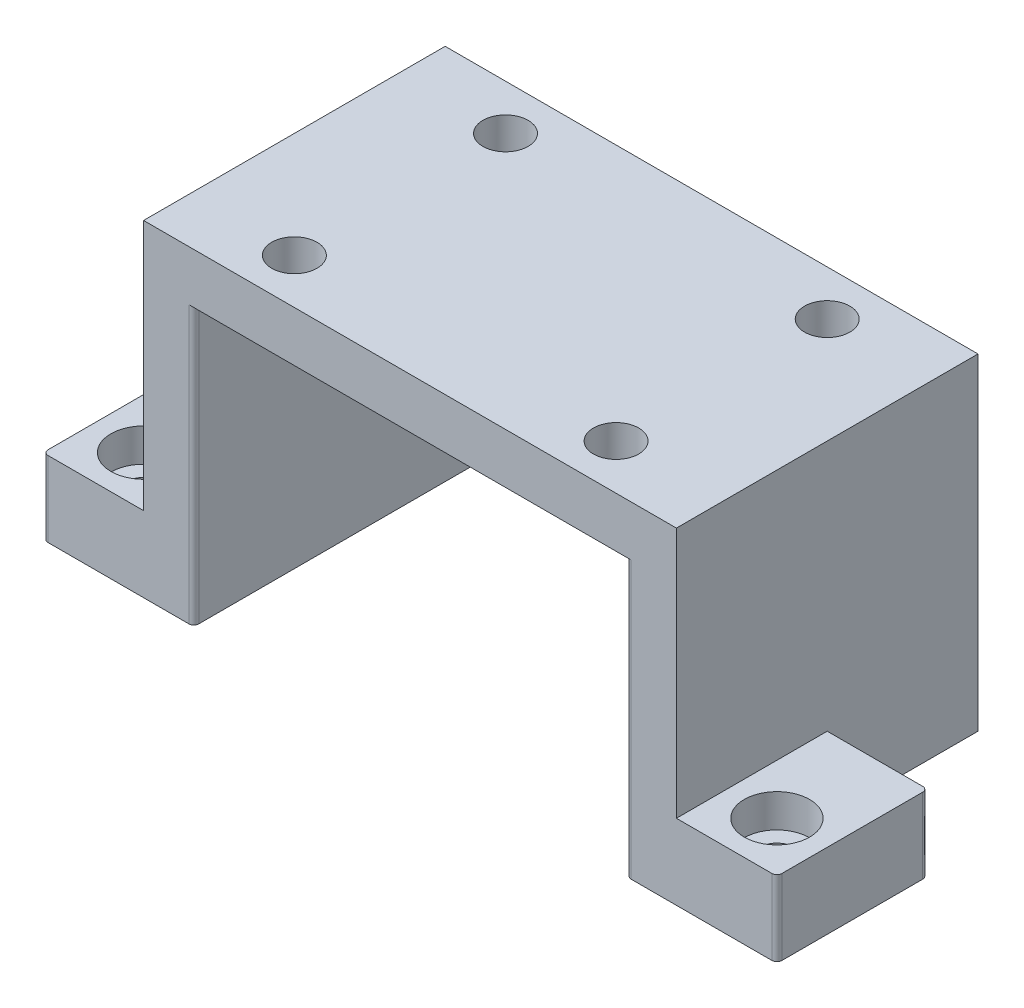
ISO-10303-21;
HEADER;
FILE_DESCRIPTION(('STEP AP214'),'2;1');
FILE_NAME('part.step','',(''),(''),'','','');
FILE_SCHEMA(('AUTOMOTIVE_DESIGN { 1 0 10303 214 1 1 1 1 }'));
ENDSEC;
DATA;
#1=APPLICATION_CONTEXT('core data for automotive mechanical design processes');
#2=APPLICATION_PROTOCOL_DEFINITION('international standard','automotive_design',2000,#1);
#3=PRODUCT_CONTEXT('',#1,'mechanical');
#4=PRODUCT('Part','Part','',(#3));
#5=PRODUCT_RELATED_PRODUCT_CATEGORY('part','',(#4));
#6=PRODUCT_DEFINITION_FORMATION('','',#4);
#7=PRODUCT_DEFINITION_CONTEXT('part definition',#1,'design');
#8=PRODUCT_DEFINITION('design','',#6,#7);
#9=PRODUCT_DEFINITION_SHAPE('','',#8);
#10=(LENGTH_UNIT() NAMED_UNIT(*) SI_UNIT(.MILLI.,.METRE.));
#11=(NAMED_UNIT(*) PLANE_ANGLE_UNIT() SI_UNIT($,.RADIAN.));
#12=(NAMED_UNIT(*) SI_UNIT($,.STERADIAN.) SOLID_ANGLE_UNIT());
#13=UNCERTAINTY_MEASURE_WITH_UNIT(LENGTH_MEASURE(1.E-05),#10,'distance_accuracy_value','');
#14=(GEOMETRIC_REPRESENTATION_CONTEXT(3) GLOBAL_UNCERTAINTY_ASSIGNED_CONTEXT((#13)) GLOBAL_UNIT_ASSIGNED_CONTEXT((#10,
#11,#12)) REPRESENTATION_CONTEXT('',''));
#15=CARTESIAN_POINT('',(0.,0.,0.));
#16=DIRECTION('',(0.,0.,1.));
#17=DIRECTION('',(1.,0.,0.));
#18=AXIS2_PLACEMENT_3D('',#15,#16,#17);
#19=CARTESIAN_POINT('',(-53.,10.,30.));
#20=DIRECTION('',(1.,0.,0.));
#21=DIRECTION('',(0.,0.,-1.));
#22=AXIS2_PLACEMENT_3D('',#19,#20,#21);
#23=PLANE('',#22);
#24=DIRECTION('',(0.,0.,-1.));
#25=VECTOR('',#24,1.);
#26=CARTESIAN_POINT('',(-53.,-40.,-30.));
#27=LINE('',#26,#25);
#28=CARTESIAN_POINT('',(-53.,-40.,30.));
#29=VERTEX_POINT('',#28);
#30=CARTESIAN_POINT('',(-53.,-40.,-30.));
#31=VERTEX_POINT('',#30);
#32=EDGE_CURVE('E204',#29,#31,#27,.T.);
#33=ORIENTED_EDGE('',*,*,#32,.F.);
#34=DIRECTION('',(0.,-1.,0.));
#35=VECTOR('',#34,1.);
#36=CARTESIAN_POINT('',(-53.,10.,30.));
#37=LINE('',#36,#35);
#38=CARTESIAN_POINT('',(-53.,10.,30.));
#39=VERTEX_POINT('',#38);
#40=EDGE_CURVE('E209',#39,#29,#37,.T.);
#41=ORIENTED_EDGE('',*,*,#40,.F.);
#42=DIRECTION('',(0.,0.,1.));
#43=VECTOR('',#42,1.);
#44=CARTESIAN_POINT('',(-53.,10.,30.));
#45=LINE('',#44,#43);
#46=CARTESIAN_POINT('',(-53.,10.,-30.));
#47=VERTEX_POINT('',#46);
#48=EDGE_CURVE('E206',#47,#39,#45,.T.);
#49=ORIENTED_EDGE('',*,*,#48,.F.);
#50=DIRECTION('',(0.,-1.,0.));
#51=VECTOR('',#50,1.);
#52=CARTESIAN_POINT('',(-53.,10.,-30.));
#53=LINE('',#52,#51);
#54=EDGE_CURVE('E191',#47,#31,#53,.T.);
#55=ORIENTED_EDGE('',*,*,#54,.T.);
#56=EDGE_LOOP('',(#33,#41,#49,#55));
#57=FACE_BOUND('',#56,.T.);
#58=ADVANCED_FACE('F42',(#57),#23,.F.);
#59=CARTESIAN_POINT('',(53.,10.,30.));
#60=DIRECTION('',(-1.,0.,0.));
#61=DIRECTION('',(0.,0.,1.));
#62=AXIS2_PLACEMENT_3D('',#59,#60,#61);
#63=PLANE('',#62);
#64=DIRECTION('',(0.,0.,1.));
#65=VECTOR('',#64,1.);
#66=CARTESIAN_POINT('',(53.,-40.,30.));
#67=LINE('',#66,#65);
#68=CARTESIAN_POINT('',(53.,-40.,0.));
#69=VERTEX_POINT('',#68);
#70=CARTESIAN_POINT('',(53.,-40.,30.));
#71=VERTEX_POINT('',#70);
#72=EDGE_CURVE('E235',#69,#71,#67,.T.);
#73=ORIENTED_EDGE('',*,*,#72,.F.);
#74=DIRECTION('',(0.,1.,0.));
#75=VECTOR('',#74,1.);
#76=CARTESIAN_POINT('',(53.,-40.,0.));
#77=LINE('',#76,#75);
#78=CARTESIAN_POINT('',(53.,-55.,0.));
#79=VERTEX_POINT('',#78);
#80=EDGE_CURVE('E229',#79,#69,#77,.T.);
#81=ORIENTED_EDGE('',*,*,#80,.F.);
#82=DIRECTION('',(0.,0.,1.));
#83=VECTOR('',#82,1.);
#84=CARTESIAN_POINT('',(53.,-55.,30.));
#85=LINE('',#84,#83);
#86=CARTESIAN_POINT('',(53.,-55.,-30.));
#87=VERTEX_POINT('',#86);
#88=EDGE_CURVE('E255',#87,#79,#85,.T.);
#89=ORIENTED_EDGE('',*,*,#88,.F.);
#90=DIRECTION('',(0.,-1.,0.));
#91=VECTOR('',#90,1.);
#92=CARTESIAN_POINT('',(53.,10.,-30.));
#93=LINE('',#92,#91);
#94=CARTESIAN_POINT('',(53.,10.,-30.));
#95=VERTEX_POINT('',#94);
#96=EDGE_CURVE('E208',#95,#87,#93,.T.);
#97=ORIENTED_EDGE('',*,*,#96,.F.);
#98=DIRECTION('',(0.,0.,-1.));
#99=VECTOR('',#98,1.);
#100=CARTESIAN_POINT('',(53.,10.,30.));
#101=LINE('',#100,#99);
#102=CARTESIAN_POINT('',(53.,10.,30.));
#103=VERTEX_POINT('',#102);
#104=EDGE_CURVE('E290',#103,#95,#101,.T.);
#105=ORIENTED_EDGE('',*,*,#104,.F.);
#106=DIRECTION('',(0.,-1.,0.));
#107=VECTOR('',#106,1.);
#108=CARTESIAN_POINT('',(53.,10.,30.));
#109=LINE('',#108,#107);
#110=EDGE_CURVE('E303',#103,#71,#109,.T.);
#111=ORIENTED_EDGE('',*,*,#110,.T.);
#112=EDGE_LOOP('',(#73,#81,#89,#97,#105,#111));
#113=FACE_BOUND('',#112,.T.);
#114=ADVANCED_FACE('F518',(#113),#63,.F.);
#115=CARTESIAN_POINT('',(0.,0.,0.));
#116=DIRECTION('',(0.,-1.,0.));
#117=DIRECTION('',(0.,0.,-1.));
#118=AXIS2_PLACEMENT_3D('',#115,#116,#117);
#119=PLANE('',#118);
#120=CARTESIAN_POINT('',(-32.,0.,21.));
#121=DIRECTION('',(0.,-1.,0.));
#122=DIRECTION('',(0.,0.,-1.));
#123=AXIS2_PLACEMENT_3D('',#120,#121,#122);
#124=CIRCLE('',#123,4.5);
#125=CARTESIAN_POINT('',(-32.,0.,16.5));
#126=VERTEX_POINT('',#125);
#127=EDGE_CURVE('E215',#126,#126,#124,.T.);
#128=ORIENTED_EDGE('',*,*,#127,.F.);
#129=EDGE_LOOP('',(#128));
#130=FACE_BOUND('',#129,.T.);
#131=CARTESIAN_POINT('',(32.,0.,21.));
#132=DIRECTION('',(0.,-1.,0.));
#133=DIRECTION('',(0.,0.,-1.));
#134=AXIS2_PLACEMENT_3D('',#131,#132,#133);
#135=CIRCLE('',#134,4.5);
#136=CARTESIAN_POINT('',(32.,0.,16.5));
#137=VERTEX_POINT('',#136);
#138=EDGE_CURVE('E223',#137,#137,#135,.T.);
#139=ORIENTED_EDGE('',*,*,#138,.F.);
#140=EDGE_LOOP('',(#139));
#141=FACE_BOUND('',#140,.T.);
#142=CARTESIAN_POINT('',(32.,0.,-21.));
#143=DIRECTION('',(0.,-1.,0.));
#144=DIRECTION('',(0.,0.,-1.));
#145=AXIS2_PLACEMENT_3D('',#142,#143,#144);
#146=CIRCLE('',#145,4.5);
#147=CARTESIAN_POINT('',(32.,0.,-25.5));
#148=VERTEX_POINT('',#147);
#149=EDGE_CURVE('E955',#148,#148,#146,.T.);
#150=ORIENTED_EDGE('',*,*,#149,.F.);
#151=EDGE_LOOP('',(#150));
#152=FACE_BOUND('',#151,.T.);
#153=CARTESIAN_POINT('',(-32.,0.,-21.));
#154=DIRECTION('',(0.,-1.,0.));
#155=DIRECTION('',(0.,0.,-1.));
#156=AXIS2_PLACEMENT_3D('',#153,#154,#155);
#157=CIRCLE('',#156,4.5);
#158=CARTESIAN_POINT('',(-32.,0.,-25.5));
#159=VERTEX_POINT('',#158);
#160=EDGE_CURVE('E958',#159,#159,#157,.T.);
#161=ORIENTED_EDGE('',*,*,#160,.F.);
#162=EDGE_LOOP('',(#161));
#163=FACE_BOUND('',#162,.T.);
#164=DIRECTION('',(-1.,0.,0.));
#165=VECTOR('',#164,1.);
#166=CARTESIAN_POINT('',(-53.,0.,-30.));
#167=LINE('',#166,#165);
#168=CARTESIAN_POINT('',(44.,0.,-30.));
#169=VERTEX_POINT('',#168);
#170=CARTESIAN_POINT('',(-44.,0.,-30.));
#171=VERTEX_POINT('',#170);
#172=EDGE_CURVE('E286',#169,#171,#167,.T.);
#173=ORIENTED_EDGE('',*,*,#172,.F.);
#174=CARTESIAN_POINT('',(44.,0.,-29.));
#175=DIRECTION('',(0.,-1.,0.));
#176=DIRECTION('',(0.,0.,-1.));
#177=AXIS2_PLACEMENT_3D('',#174,#175,#176);
#178=CIRCLE('',#177,1.);
#179=CARTESIAN_POINT('',(43.,0.,-29.));
#180=VERTEX_POINT('',#179);
#181=EDGE_CURVE('E408',#169,#180,#178,.F.);
#182=ORIENTED_EDGE('',*,*,#181,.T.);
#183=DIRECTION('',(0.,0.,-1.));
#184=VECTOR('',#183,1.);
#185=CARTESIAN_POINT('',(43.,0.,30.));
#186=LINE('',#185,#184);
#187=CARTESIAN_POINT('',(43.,0.,29.));
#188=VERTEX_POINT('',#187);
#189=EDGE_CURVE('E254',#188,#180,#186,.T.);
#190=ORIENTED_EDGE('',*,*,#189,.F.);
#191=CARTESIAN_POINT('',(44.,0.,29.));
#192=DIRECTION('',(0.,-1.,0.));
#193=DIRECTION('',(0.,0.,-1.));
#194=AXIS2_PLACEMENT_3D('',#191,#192,#193);
#195=CIRCLE('',#194,1.);
#196=CARTESIAN_POINT('',(44.,0.,30.));
#197=VERTEX_POINT('',#196);
#198=EDGE_CURVE('E404',#188,#197,#195,.F.);
#199=ORIENTED_EDGE('',*,*,#198,.T.);
#200=DIRECTION('',(1.,0.,0.));
#201=VECTOR('',#200,1.);
#202=CARTESIAN_POINT('',(-53.,0.,30.));
#203=LINE('',#202,#201);
#204=CARTESIAN_POINT('',(-44.,0.,30.));
#205=VERTEX_POINT('',#204);
#206=EDGE_CURVE('E295',#205,#197,#203,.T.);
#207=ORIENTED_EDGE('',*,*,#206,.F.);
#208=CARTESIAN_POINT('',(-44.,0.,29.));
#209=DIRECTION('',(0.,-1.,0.));
#210=DIRECTION('',(0.,0.,-1.));
#211=AXIS2_PLACEMENT_3D('',#208,#209,#210);
#212=CIRCLE('',#211,1.);
#213=CARTESIAN_POINT('',(-43.,0.,29.));
#214=VERTEX_POINT('',#213);
#215=EDGE_CURVE('E11',#205,#214,#212,.F.);
#216=ORIENTED_EDGE('',*,*,#215,.T.);
#217=DIRECTION('',(0.,0.,1.));
#218=VECTOR('',#217,1.);
#219=CARTESIAN_POINT('',(-43.,0.,30.));
#220=LINE('',#219,#218);
#221=CARTESIAN_POINT('',(-43.,0.,-29.));
#222=VERTEX_POINT('',#221);
#223=EDGE_CURVE('E270',#222,#214,#220,.T.);
#224=ORIENTED_EDGE('',*,*,#223,.F.);
#225=CARTESIAN_POINT('',(-44.,0.,-29.));
#226=DIRECTION('',(0.,-1.,0.));
#227=DIRECTION('',(0.,0.,-1.));
#228=AXIS2_PLACEMENT_3D('',#225,#226,#227);
#229=CIRCLE('',#228,1.);
#230=EDGE_CURVE('E51',#222,#171,#229,.F.);
#231=ORIENTED_EDGE('',*,*,#230,.T.);
#232=EDGE_LOOP('',(#173,#182,#190,#199,#207,#216,#224,#231));
#233=FACE_BOUND('',#232,.T.);
#234=ADVANCED_FACE('F416',(#130,#141,#152,#163,#233),#119,.T.);
#235=CARTESIAN_POINT('',(-53.,10.,-30.));
#236=DIRECTION('',(0.,0.,1.));
#237=DIRECTION('',(1.,0.,0.));
#238=AXIS2_PLACEMENT_3D('',#235,#236,#237);
#239=PLANE('',#238);
#240=DIRECTION('',(1.,0.,0.));
#241=VECTOR('',#240,1.);
#242=CARTESIAN_POINT('',(53.,-55.,-30.));
#243=LINE('',#242,#241);
#244=CARTESIAN_POINT('',(44.,-55.,-30.));
#245=VERTEX_POINT('',#244);
#246=EDGE_CURVE('E267',#245,#87,#243,.T.);
#247=ORIENTED_EDGE('',*,*,#246,.F.);
#248=DIRECTION('',(0.,1.,0.));
#249=VECTOR('',#248,1.);
#250=CARTESIAN_POINT('',(44.,10.,-30.));
#251=LINE('',#250,#249);
#252=EDGE_CURVE('E370',#245,#169,#251,.T.);
#253=ORIENTED_EDGE('',*,*,#252,.T.);
#254=ORIENTED_EDGE('',*,*,#172,.T.);
#255=DIRECTION('',(0.,1.,0.));
#256=VECTOR('',#255,1.);
#257=CARTESIAN_POINT('',(-44.,10.,-30.));
#258=LINE('',#257,#256);
#259=CARTESIAN_POINT('',(-44.,-55.,-30.));
#260=VERTEX_POINT('',#259);
#261=EDGE_CURVE('E367',#171,#260,#258,.F.);
#262=ORIENTED_EDGE('',*,*,#261,.T.);
#263=DIRECTION('',(1.,0.,0.));
#264=VECTOR('',#263,1.);
#265=CARTESIAN_POINT('',(-53.,-55.,-30.));
#266=LINE('',#265,#264);
#267=CARTESIAN_POINT('',(-72.,-55.,-30.));
#268=VERTEX_POINT('',#267);
#269=EDGE_CURVE('E274',#268,#260,#266,.T.);
#270=ORIENTED_EDGE('',*,*,#269,.F.);
#271=DIRECTION('',(0.,-1.,0.));
#272=VECTOR('',#271,1.);
#273=CARTESIAN_POINT('',(-72.,10.,-30.));
#274=LINE('',#273,#272);
#275=CARTESIAN_POINT('',(-72.,-40.,-30.));
#276=VERTEX_POINT('',#275);
#277=EDGE_CURVE('E195',#268,#276,#274,.F.);
#278=ORIENTED_EDGE('',*,*,#277,.T.);
#279=DIRECTION('',(1.,0.,0.));
#280=VECTOR('',#279,1.);
#281=CARTESIAN_POINT('',(-73.,-40.,-30.));
#282=LINE('',#281,#280);
#283=EDGE_CURVE('E187',#276,#31,#282,.T.);
#284=ORIENTED_EDGE('',*,*,#283,.T.);
#285=ORIENTED_EDGE('',*,*,#54,.F.);
#286=DIRECTION('',(-1.,0.,0.));
#287=VECTOR('',#286,1.);
#288=CARTESIAN_POINT('',(-53.,10.,-30.));
#289=LINE('',#288,#287);
#290=EDGE_CURVE('E294',#95,#47,#289,.T.);
#291=ORIENTED_EDGE('',*,*,#290,.F.);
#292=ORIENTED_EDGE('',*,*,#96,.T.);
#293=EDGE_LOOP('',(#247,#253,#254,#262,#270,#278,#284,#285,#291,#292));
#294=FACE_BOUND('',#293,.T.);
#295=ADVANCED_FACE('F190',(#294),#239,.F.);
#296=CARTESIAN_POINT('',(-53.,10.,30.));
#297=DIRECTION('',(0.,0.,-1.));
#298=DIRECTION('',(-1.,0.,0.));
#299=AXIS2_PLACEMENT_3D('',#296,#297,#298);
#300=PLANE('',#299);
#301=ORIENTED_EDGE('',*,*,#206,.T.);
#302=DIRECTION('',(0.,1.,0.));
#303=VECTOR('',#302,1.);
#304=CARTESIAN_POINT('',(44.,10.,30.));
#305=LINE('',#304,#303);
#306=CARTESIAN_POINT('',(44.,-55.,30.));
#307=VERTEX_POINT('',#306);
#308=EDGE_CURVE('E333',#197,#307,#305,.F.);
#309=ORIENTED_EDGE('',*,*,#308,.T.);
#310=DIRECTION('',(-1.,0.,0.));
#311=VECTOR('',#310,1.);
#312=CARTESIAN_POINT('',(53.,-55.,30.));
#313=LINE('',#312,#311);
#314=CARTESIAN_POINT('',(72.,-55.,30.));
#315=VERTEX_POINT('',#314);
#316=EDGE_CURVE('E259',#315,#307,#313,.T.);
#317=ORIENTED_EDGE('',*,*,#316,.F.);
#318=DIRECTION('',(0.,-1.,0.));
#319=VECTOR('',#318,1.);
#320=CARTESIAN_POINT('',(72.,10.,30.));
#321=LINE('',#320,#319);
#322=CARTESIAN_POINT('',(72.,-40.,30.));
#323=VERTEX_POINT('',#322);
#324=EDGE_CURVE('E330',#315,#323,#321,.F.);
#325=ORIENTED_EDGE('',*,*,#324,.T.);
#326=DIRECTION('',(-1.,0.,0.));
#327=VECTOR('',#326,1.);
#328=CARTESIAN_POINT('',(73.,-40.,30.));
#329=LINE('',#328,#327);
#330=EDGE_CURVE('E239',#323,#71,#329,.T.);
#331=ORIENTED_EDGE('',*,*,#330,.T.);
#332=ORIENTED_EDGE('',*,*,#110,.F.);
#333=DIRECTION('',(1.,0.,0.));
#334=VECTOR('',#333,1.);
#335=CARTESIAN_POINT('',(-53.,10.,30.));
#336=LINE('',#335,#334);
#337=EDGE_CURVE('E300',#39,#103,#336,.T.);
#338=ORIENTED_EDGE('',*,*,#337,.F.);
#339=ORIENTED_EDGE('',*,*,#40,.T.);
#340=DIRECTION('',(1.,0.,0.));
#341=VECTOR('',#340,1.);
#342=CARTESIAN_POINT('',(-73.,-40.,30.));
#343=LINE('',#342,#341);
#344=CARTESIAN_POINT('',(-72.,-40.,30.));
#345=VERTEX_POINT('',#344);
#346=EDGE_CURVE('E198',#345,#29,#343,.T.);
#347=ORIENTED_EDGE('',*,*,#346,.F.);
#348=DIRECTION('',(0.,1.,0.));
#349=VECTOR('',#348,1.);
#350=CARTESIAN_POINT('',(-72.,10.,30.));
#351=LINE('',#350,#349);
#352=CARTESIAN_POINT('',(-72.,-55.,30.));
#353=VERTEX_POINT('',#352);
#354=EDGE_CURVE('E327',#345,#353,#351,.F.);
#355=ORIENTED_EDGE('',*,*,#354,.T.);
#356=DIRECTION('',(-1.,0.,0.));
#357=VECTOR('',#356,1.);
#358=CARTESIAN_POINT('',(-53.,-55.,30.));
#359=LINE('',#358,#357);
#360=CARTESIAN_POINT('',(-44.,-55.,30.));
#361=VERTEX_POINT('',#360);
#362=EDGE_CURVE('E282',#361,#353,#359,.T.);
#363=ORIENTED_EDGE('',*,*,#362,.F.);
#364=DIRECTION('',(0.,1.,0.));
#365=VECTOR('',#364,1.);
#366=CARTESIAN_POINT('',(-44.,10.,30.));
#367=LINE('',#366,#365);
#368=EDGE_CURVE('E323',#361,#205,#367,.T.);
#369=ORIENTED_EDGE('',*,*,#368,.T.);
#370=EDGE_LOOP('',(#301,#309,#317,#325,#331,#332,#338,#339,#347,#355,#363,#369));
#371=FACE_BOUND('',#370,.T.);
#372=ADVANCED_FACE('F493',(#371),#300,.F.);
#373=CARTESIAN_POINT('',(0.,10.,0.));
#374=DIRECTION('',(0.,-1.,0.));
#375=DIRECTION('',(0.,0.,-1.));
#376=AXIS2_PLACEMENT_3D('',#373,#374,#375);
#377=PLANE('',#376);
#378=CARTESIAN_POINT('',(-32.,10.,21.));
#379=DIRECTION('',(0.,1.,0.));
#380=DIRECTION('',(0.,0.,-1.));
#381=AXIS2_PLACEMENT_3D('',#378,#379,#380);
#382=CIRCLE('',#381,4.5);
#383=CARTESIAN_POINT('',(-32.,10.,16.5));
#384=VERTEX_POINT('',#383);
#385=EDGE_CURVE('E979',#384,#384,#382,.T.);
#386=ORIENTED_EDGE('',*,*,#385,.F.);
#387=EDGE_LOOP('',(#386));
#388=FACE_BOUND('',#387,.T.);
#389=CARTESIAN_POINT('',(32.,10.,21.));
#390=DIRECTION('',(0.,1.,0.));
#391=DIRECTION('',(0.,0.,1.));
#392=AXIS2_PLACEMENT_3D('',#389,#390,#391);
#393=CIRCLE('',#392,4.5);
#394=CARTESIAN_POINT('',(32.,10.,25.5));
#395=VERTEX_POINT('',#394);
#396=EDGE_CURVE('E976',#395,#395,#393,.T.);
#397=ORIENTED_EDGE('',*,*,#396,.F.);
#398=EDGE_LOOP('',(#397));
#399=FACE_BOUND('',#398,.T.);
#400=CARTESIAN_POINT('',(32.,10.,-21.));
#401=DIRECTION('',(0.,1.,0.));
#402=DIRECTION('',(0.,0.,-1.));
#403=AXIS2_PLACEMENT_3D('',#400,#401,#402);
#404=CIRCLE('',#403,4.5);
#405=CARTESIAN_POINT('',(32.,10.,-25.5));
#406=VERTEX_POINT('',#405);
#407=EDGE_CURVE('E967',#406,#406,#404,.T.);
#408=ORIENTED_EDGE('',*,*,#407,.F.);
#409=EDGE_LOOP('',(#408));
#410=FACE_BOUND('',#409,.T.);
#411=CARTESIAN_POINT('',(-32.,10.,-21.));
#412=DIRECTION('',(0.,1.,0.));
#413=DIRECTION('',(0.,0.,1.));
#414=AXIS2_PLACEMENT_3D('',#411,#412,#413);
#415=CIRCLE('',#414,4.5);
#416=CARTESIAN_POINT('',(-32.,10.,-16.5));
#417=VERTEX_POINT('',#416);
#418=EDGE_CURVE('E960',#417,#417,#415,.T.);
#419=ORIENTED_EDGE('',*,*,#418,.F.);
#420=EDGE_LOOP('',(#419));
#421=FACE_BOUND('',#420,.T.);
#422=ORIENTED_EDGE('',*,*,#104,.T.);
#423=ORIENTED_EDGE('',*,*,#290,.T.);
#424=ORIENTED_EDGE('',*,*,#48,.T.);
#425=ORIENTED_EDGE('',*,*,#337,.T.);
#426=EDGE_LOOP('',(#422,#423,#424,#425));
#427=FACE_BOUND('',#426,.T.);
#428=ADVANCED_FACE('F506',(#388,#399,#410,#421,#427),#377,.F.);
#429=CARTESIAN_POINT('',(-43.,-55.,30.));
#430=DIRECTION('',(-1.,0.,0.));
#431=DIRECTION('',(0.,0.,1.));
#432=AXIS2_PLACEMENT_3D('',#429,#430,#431);
#433=PLANE('',#432);
#434=DIRECTION('',(0.,0.,1.));
#435=VECTOR('',#434,1.);
#436=CARTESIAN_POINT('',(-43.,-55.,30.));
#437=LINE('',#436,#435);
#438=CARTESIAN_POINT('',(-43.,-55.,-29.));
#439=VERTEX_POINT('',#438);
#440=CARTESIAN_POINT('',(-43.,-55.,29.));
#441=VERTEX_POINT('',#440);
#442=EDGE_CURVE('E278',#439,#441,#437,.T.);
#443=ORIENTED_EDGE('',*,*,#442,.F.);
#444=DIRECTION('',(0.,1.,0.));
#445=VECTOR('',#444,1.);
#446=CARTESIAN_POINT('',(-43.,-55.,-29.));
#447=LINE('',#446,#445);
#448=EDGE_CURVE('E377',#439,#222,#447,.T.);
#449=ORIENTED_EDGE('',*,*,#448,.T.);
#450=ORIENTED_EDGE('',*,*,#223,.T.);
#451=DIRECTION('',(0.,1.,0.));
#452=VECTOR('',#451,1.);
#453=CARTESIAN_POINT('',(-43.,-55.,29.));
#454=LINE('',#453,#452);
#455=EDGE_CURVE('E374',#214,#441,#454,.F.);
#456=ORIENTED_EDGE('',*,*,#455,.T.);
#457=EDGE_LOOP('',(#443,#449,#450,#456));
#458=FACE_BOUND('',#457,.T.);
#459=ADVANCED_FACE('F504',(#458),#433,.F.);
#460=CARTESIAN_POINT('',(0.,-55.,0.));
#461=DIRECTION('',(0.,-1.,0.));
#462=DIRECTION('',(0.,0.,-1.));
#463=AXIS2_PLACEMENT_3D('',#460,#461,#462);
#464=PLANE('',#463);
#465=CARTESIAN_POINT('',(-63.,-55.,-20.));
#466=DIRECTION('',(0.,1.,0.));
#467=DIRECTION('',(0.,0.,1.));
#468=AXIS2_PLACEMENT_3D('',#465,#466,#467);
#469=CIRCLE('',#468,3.3);
#470=CARTESIAN_POINT('',(-63.,-55.,-16.7));
#471=VERTEX_POINT('',#470);
#472=EDGE_CURVE('E994',#471,#471,#469,.T.);
#473=ORIENTED_EDGE('',*,*,#472,.T.);
#474=EDGE_LOOP('',(#473));
#475=FACE_BOUND('',#474,.T.);
#476=CARTESIAN_POINT('',(-63.,-55.,20.));
#477=DIRECTION('',(0.,1.,0.));
#478=DIRECTION('',(0.,0.,1.));
#479=AXIS2_PLACEMENT_3D('',#476,#477,#478);
#480=CIRCLE('',#479,3.3);
#481=CARTESIAN_POINT('',(-63.,-55.,23.3));
#482=VERTEX_POINT('',#481);
#483=EDGE_CURVE('E1025',#482,#482,#480,.T.);
#484=ORIENTED_EDGE('',*,*,#483,.T.);
#485=EDGE_LOOP('',(#484));
#486=FACE_BOUND('',#485,.T.);
#487=ORIENTED_EDGE('',*,*,#269,.T.);
#488=CARTESIAN_POINT('',(-44.,-55.,-29.));
#489=DIRECTION('',(0.,-1.,0.));
#490=DIRECTION('',(0.,0.,-1.));
#491=AXIS2_PLACEMENT_3D('',#488,#489,#490);
#492=CIRCLE('',#491,1.);
#493=EDGE_CURVE('E390',#260,#439,#492,.T.);
#494=ORIENTED_EDGE('',*,*,#493,.T.);
#495=ORIENTED_EDGE('',*,*,#442,.T.);
#496=CARTESIAN_POINT('',(-44.,-55.,29.));
#497=DIRECTION('',(0.,-1.,0.));
#498=DIRECTION('',(0.,0.,-1.));
#499=AXIS2_PLACEMENT_3D('',#496,#497,#498);
#500=CIRCLE('',#499,1.);
#501=EDGE_CURVE('E381',#441,#361,#500,.T.);
#502=ORIENTED_EDGE('',*,*,#501,.T.);
#503=ORIENTED_EDGE('',*,*,#362,.T.);
#504=CARTESIAN_POINT('',(-72.,-55.,29.));
#505=DIRECTION('',(0.,-1.,0.));
#506=DIRECTION('',(0.,0.,-1.));
#507=AXIS2_PLACEMENT_3D('',#504,#505,#506);
#508=CIRCLE('',#507,1.);
#509=CARTESIAN_POINT('',(-73.,-55.,29.));
#510=VERTEX_POINT('',#509);
#511=EDGE_CURVE('E384',#353,#510,#508,.T.);
#512=ORIENTED_EDGE('',*,*,#511,.T.);
#513=DIRECTION('',(0.,0.,1.));
#514=VECTOR('',#513,1.);
#515=CARTESIAN_POINT('',(-73.,-55.,-30.));
#516=LINE('',#515,#514);
#517=CARTESIAN_POINT('',(-73.,-55.,-29.));
#518=VERTEX_POINT('',#517);
#519=EDGE_CURVE('E214',#518,#510,#516,.T.);
#520=ORIENTED_EDGE('',*,*,#519,.F.);
#521=CARTESIAN_POINT('',(-72.,-55.,-29.));
#522=DIRECTION('',(0.,-1.,0.));
#523=DIRECTION('',(0.,0.,-1.));
#524=AXIS2_PLACEMENT_3D('',#521,#522,#523);
#525=CIRCLE('',#524,1.);
#526=EDGE_CURVE('E387',#518,#268,#525,.T.);
#527=ORIENTED_EDGE('',*,*,#526,.T.);
#528=EDGE_LOOP('',(#487,#494,#495,#502,#503,#512,#520,#527));
#529=FACE_BOUND('',#528,.T.);
#530=ADVANCED_FACE('F423',(#475,#486,#529),#464,.T.);
#531=CARTESIAN_POINT('',(43.,-55.,30.));
#532=DIRECTION('',(1.,0.,0.));
#533=DIRECTION('',(0.,0.,-1.));
#534=AXIS2_PLACEMENT_3D('',#531,#532,#533);
#535=PLANE('',#534);
#536=DIRECTION('',(0.,0.,-1.));
#537=VECTOR('',#536,1.);
#538=CARTESIAN_POINT('',(43.,-55.,30.));
#539=LINE('',#538,#537);
#540=CARTESIAN_POINT('',(43.,-55.,29.));
#541=VERTEX_POINT('',#540);
#542=CARTESIAN_POINT('',(43.,-55.,-29.));
#543=VERTEX_POINT('',#542);
#544=EDGE_CURVE('E263',#541,#543,#539,.T.);
#545=ORIENTED_EDGE('',*,*,#544,.F.);
#546=DIRECTION('',(0.,1.,0.));
#547=VECTOR('',#546,1.);
#548=CARTESIAN_POINT('',(43.,-55.,29.));
#549=LINE('',#548,#547);
#550=EDGE_CURVE('E319',#541,#188,#549,.T.);
#551=ORIENTED_EDGE('',*,*,#550,.T.);
#552=ORIENTED_EDGE('',*,*,#189,.T.);
#553=DIRECTION('',(0.,1.,0.));
#554=VECTOR('',#553,1.);
#555=CARTESIAN_POINT('',(43.,-55.,-29.));
#556=LINE('',#555,#554);
#557=EDGE_CURVE('E316',#180,#543,#556,.F.);
#558=ORIENTED_EDGE('',*,*,#557,.T.);
#559=EDGE_LOOP('',(#545,#551,#552,#558));
#560=FACE_BOUND('',#559,.T.);
#561=ADVANCED_FACE('F512',(#560),#535,.F.);
#562=CARTESIAN_POINT('',(0.,-55.,0.));
#563=DIRECTION('',(0.,1.,0.));
#564=DIRECTION('',(0.,0.,1.));
#565=AXIS2_PLACEMENT_3D('',#562,#563,#564);
#566=PLANE('',#565);
#567=CARTESIAN_POINT('',(63.,-55.,20.));
#568=DIRECTION('',(0.,1.,0.));
#569=DIRECTION('',(0.,0.,1.));
#570=AXIS2_PLACEMENT_3D('',#567,#568,#569);
#571=CIRCLE('',#570,3.29999999999999);
#572=CARTESIAN_POINT('',(63.,-55.,23.3));
#573=VERTEX_POINT('',#572);
#574=EDGE_CURVE('E1017',#573,#573,#571,.T.);
#575=ORIENTED_EDGE('',*,*,#574,.T.);
#576=EDGE_LOOP('',(#575));
#577=FACE_BOUND('',#576,.T.);
#578=ORIENTED_EDGE('',*,*,#316,.T.);
#579=CARTESIAN_POINT('',(44.,-55.,29.));
#580=DIRECTION('',(0.,1.,0.));
#581=DIRECTION('',(0.,0.,1.));
#582=AXIS2_PLACEMENT_3D('',#579,#580,#581);
#583=CIRCLE('',#582,1.);
#584=EDGE_CURVE('E345',#307,#541,#583,.F.);
#585=ORIENTED_EDGE('',*,*,#584,.T.);
#586=ORIENTED_EDGE('',*,*,#544,.T.);
#587=CARTESIAN_POINT('',(44.,-55.,-29.));
#588=DIRECTION('',(0.,1.,0.));
#589=DIRECTION('',(0.,0.,1.));
#590=AXIS2_PLACEMENT_3D('',#587,#588,#589);
#591=CIRCLE('',#590,1.);
#592=EDGE_CURVE('E336',#543,#245,#591,.F.);
#593=ORIENTED_EDGE('',*,*,#592,.T.);
#594=ORIENTED_EDGE('',*,*,#246,.T.);
#595=ORIENTED_EDGE('',*,*,#88,.T.);
#596=DIRECTION('',(-1.,0.,0.));
#597=VECTOR('',#596,1.);
#598=CARTESIAN_POINT('',(73.,-55.,0.));
#599=LINE('',#598,#597);
#600=CARTESIAN_POINT('',(72.,-55.,0.));
#601=VERTEX_POINT('',#600);
#602=EDGE_CURVE('E251',#601,#79,#599,.T.);
#603=ORIENTED_EDGE('',*,*,#602,.F.);
#604=CARTESIAN_POINT('',(72.,-55.,1.));
#605=DIRECTION('',(0.,1.,0.));
#606=DIRECTION('',(0.,0.,1.));
#607=AXIS2_PLACEMENT_3D('',#604,#605,#606);
#608=CIRCLE('',#607,1.);
#609=CARTESIAN_POINT('',(73.,-55.,1.));
#610=VERTEX_POINT('',#609);
#611=EDGE_CURVE('E342',#601,#610,#608,.F.);
#612=ORIENTED_EDGE('',*,*,#611,.T.);
#613=DIRECTION('',(0.,0.,-1.));
#614=VECTOR('',#613,1.);
#615=CARTESIAN_POINT('',(73.,-55.,30.));
#616=LINE('',#615,#614);
#617=CARTESIAN_POINT('',(73.,-55.,29.));
#618=VERTEX_POINT('',#617);
#619=EDGE_CURVE('E230',#618,#610,#616,.T.);
#620=ORIENTED_EDGE('',*,*,#619,.F.);
#621=CARTESIAN_POINT('',(72.,-55.,29.));
#622=DIRECTION('',(0.,1.,0.));
#623=DIRECTION('',(0.,0.,1.));
#624=AXIS2_PLACEMENT_3D('',#621,#622,#623);
#625=CIRCLE('',#624,1.);
#626=EDGE_CURVE('E339',#618,#315,#625,.F.);
#627=ORIENTED_EDGE('',*,*,#626,.T.);
#628=EDGE_LOOP('',(#578,#585,#586,#593,#594,#595,#603,#612,#620,#627));
#629=FACE_BOUND('',#628,.T.);
#630=ADVANCED_FACE('F774',(#577,#629),#566,.F.);
#631=CARTESIAN_POINT('',(73.,-40.,0.));
#632=DIRECTION('',(0.,0.,1.));
#633=DIRECTION('',(1.,0.,0.));
#634=AXIS2_PLACEMENT_3D('',#631,#632,#633);
#635=PLANE('',#634);
#636=DIRECTION('',(-1.,0.,0.));
#637=VECTOR('',#636,1.);
#638=CARTESIAN_POINT('',(73.,-40.,0.));
#639=LINE('',#638,#637);
#640=CARTESIAN_POINT('',(72.,-40.,0.));
#641=VERTEX_POINT('',#640);
#642=EDGE_CURVE('E248',#641,#69,#639,.T.);
#643=ORIENTED_EDGE('',*,*,#642,.F.);
#644=DIRECTION('',(0.,1.,0.));
#645=VECTOR('',#644,1.);
#646=CARTESIAN_POINT('',(72.,-40.,0.));
#647=LINE('',#646,#645);
#648=EDGE_CURVE('E362',#641,#601,#647,.F.);
#649=ORIENTED_EDGE('',*,*,#648,.T.);
#650=ORIENTED_EDGE('',*,*,#602,.T.);
#651=ORIENTED_EDGE('',*,*,#80,.T.);
#652=EDGE_LOOP('',(#643,#649,#650,#651));
#653=FACE_BOUND('',#652,.T.);
#654=ADVANCED_FACE('F764',(#653),#635,.F.);
#655=CARTESIAN_POINT('',(73.,-40.,30.));
#656=DIRECTION('',(0.,-1.,0.));
#657=DIRECTION('',(0.,0.,-1.));
#658=AXIS2_PLACEMENT_3D('',#655,#656,#657);
#659=PLANE('',#658);
#660=CARTESIAN_POINT('',(63.,-40.,20.));
#661=DIRECTION('',(0.,1.,0.));
#662=DIRECTION('',(0.,0.,1.));
#663=AXIS2_PLACEMENT_3D('',#660,#661,#662);
#664=CIRCLE('',#663,6.5);
#665=CARTESIAN_POINT('',(63.,-40.,26.5));
#666=VERTEX_POINT('',#665);
#667=EDGE_CURVE('E1006',#666,#666,#664,.T.);
#668=ORIENTED_EDGE('',*,*,#667,.F.);
#669=EDGE_LOOP('',(#668));
#670=FACE_BOUND('',#669,.T.);
#671=DIRECTION('',(0.,0.,1.));
#672=VECTOR('',#671,1.);
#673=CARTESIAN_POINT('',(73.,-40.,30.));
#674=LINE('',#673,#672);
#675=CARTESIAN_POINT('',(73.,-40.,1.));
#676=VERTEX_POINT('',#675);
#677=CARTESIAN_POINT('',(73.,-40.,29.));
#678=VERTEX_POINT('',#677);
#679=EDGE_CURVE('E234',#676,#678,#674,.T.);
#680=ORIENTED_EDGE('',*,*,#679,.F.);
#681=CARTESIAN_POINT('',(72.,-40.,1.));
#682=DIRECTION('',(0.,-1.,0.));
#683=DIRECTION('',(0.,0.,-1.));
#684=AXIS2_PLACEMENT_3D('',#681,#682,#683);
#685=CIRCLE('',#684,1.);
#686=EDGE_CURVE('E359',#676,#641,#685,.F.);
#687=ORIENTED_EDGE('',*,*,#686,.T.);
#688=ORIENTED_EDGE('',*,*,#642,.T.);
#689=ORIENTED_EDGE('',*,*,#72,.T.);
#690=ORIENTED_EDGE('',*,*,#330,.F.);
#691=CARTESIAN_POINT('',(72.,-40.,29.));
#692=DIRECTION('',(0.,-1.,0.));
#693=DIRECTION('',(0.,0.,-1.));
#694=AXIS2_PLACEMENT_3D('',#691,#692,#693);
#695=CIRCLE('',#694,1.);
#696=EDGE_CURVE('E356',#323,#678,#695,.F.);
#697=ORIENTED_EDGE('',*,*,#696,.T.);
#698=EDGE_LOOP('',(#680,#687,#688,#689,#690,#697));
#699=FACE_BOUND('',#698,.T.);
#700=ADVANCED_FACE('F754',(#670,#699),#659,.F.);
#701=CARTESIAN_POINT('',(73.,0.,0.));
#702=DIRECTION('',(-1.,0.,0.));
#703=DIRECTION('',(0.,0.,1.));
#704=AXIS2_PLACEMENT_3D('',#701,#702,#703);
#705=PLANE('',#704);
#706=ORIENTED_EDGE('',*,*,#619,.T.);
#707=DIRECTION('',(0.,1.,0.));
#708=VECTOR('',#707,1.);
#709=CARTESIAN_POINT('',(73.,0.,1.));
#710=LINE('',#709,#708);
#711=EDGE_CURVE('E352',#610,#676,#710,.T.);
#712=ORIENTED_EDGE('',*,*,#711,.T.);
#713=ORIENTED_EDGE('',*,*,#679,.T.);
#714=DIRECTION('',(0.,-1.,0.));
#715=VECTOR('',#714,1.);
#716=CARTESIAN_POINT('',(73.,0.,29.));
#717=LINE('',#716,#715);
#718=EDGE_CURVE('E348',#678,#618,#717,.T.);
#719=ORIENTED_EDGE('',*,*,#718,.T.);
#720=EDGE_LOOP('',(#706,#712,#713,#719));
#721=FACE_BOUND('',#720,.T.);
#722=ADVANCED_FACE('F744',(#721),#705,.F.);
#723=CARTESIAN_POINT('',(-73.,-40.,-30.));
#724=DIRECTION('',(0.,-1.,0.));
#725=DIRECTION('',(0.,0.,-1.));
#726=AXIS2_PLACEMENT_3D('',#723,#724,#725);
#727=PLANE('',#726);
#728=CARTESIAN_POINT('',(-63.,-40.,-20.));
#729=DIRECTION('',(0.,1.,0.));
#730=DIRECTION('',(0.,0.,1.));
#731=AXIS2_PLACEMENT_3D('',#728,#729,#730);
#732=CIRCLE('',#731,6.5);
#733=CARTESIAN_POINT('',(-63.,-40.,-13.5));
#734=VERTEX_POINT('',#733);
#735=EDGE_CURVE('E998',#734,#734,#732,.T.);
#736=ORIENTED_EDGE('',*,*,#735,.F.);
#737=EDGE_LOOP('',(#736));
#738=FACE_BOUND('',#737,.T.);
#739=CARTESIAN_POINT('',(-63.,-40.,20.));
#740=DIRECTION('',(0.,1.,0.));
#741=DIRECTION('',(0.,0.,1.));
#742=AXIS2_PLACEMENT_3D('',#739,#740,#741);
#743=CIRCLE('',#742,6.5);
#744=CARTESIAN_POINT('',(-63.,-40.,26.5));
#745=VERTEX_POINT('',#744);
#746=EDGE_CURVE('E989',#745,#745,#743,.T.);
#747=ORIENTED_EDGE('',*,*,#746,.F.);
#748=EDGE_LOOP('',(#747));
#749=FACE_BOUND('',#748,.T.);
#750=ORIENTED_EDGE('',*,*,#283,.F.);
#751=CARTESIAN_POINT('',(-72.,-40.,-29.));
#752=DIRECTION('',(0.,-1.,0.));
#753=DIRECTION('',(0.,0.,-1.));
#754=AXIS2_PLACEMENT_3D('',#751,#752,#753);
#755=CIRCLE('',#754,1.);
#756=CARTESIAN_POINT('',(-73.,-40.,-29.));
#757=VERTEX_POINT('',#756);
#758=EDGE_CURVE('E58',#276,#757,#755,.F.);
#759=ORIENTED_EDGE('',*,*,#758,.T.);
#760=DIRECTION('',(0.,0.,-1.));
#761=VECTOR('',#760,1.);
#762=CARTESIAN_POINT('',(-73.,-40.,-30.));
#763=LINE('',#762,#761);
#764=CARTESIAN_POINT('',(-73.,-40.,29.));
#765=VERTEX_POINT('',#764);
#766=EDGE_CURVE('E199',#765,#757,#763,.T.);
#767=ORIENTED_EDGE('',*,*,#766,.F.);
#768=CARTESIAN_POINT('',(-72.,-40.,29.));
#769=DIRECTION('',(0.,-1.,0.));
#770=DIRECTION('',(0.,0.,-1.));
#771=AXIS2_PLACEMENT_3D('',#768,#769,#770);
#772=CIRCLE('',#771,1.);
#773=EDGE_CURVE('E66',#765,#345,#772,.F.);
#774=ORIENTED_EDGE('',*,*,#773,.T.);
#775=ORIENTED_EDGE('',*,*,#346,.T.);
#776=ORIENTED_EDGE('',*,*,#32,.T.);
#777=EDGE_LOOP('',(#750,#759,#767,#774,#775,#776));
#778=FACE_BOUND('',#777,.T.);
#779=ADVANCED_FACE('F211',(#738,#749,#778),#727,.F.);
#780=CARTESIAN_POINT('',(-73.,0.,0.));
#781=DIRECTION('',(1.,0.,0.));
#782=DIRECTION('',(0.,0.,-1.));
#783=AXIS2_PLACEMENT_3D('',#780,#781,#782);
#784=PLANE('',#783);
#785=ORIENTED_EDGE('',*,*,#766,.T.);
#786=DIRECTION('',(0.,-1.,0.));
#787=VECTOR('',#786,1.);
#788=CARTESIAN_POINT('',(-73.,0.,-29.));
#789=LINE('',#788,#787);
#790=EDGE_CURVE('E396',#757,#518,#789,.T.);
#791=ORIENTED_EDGE('',*,*,#790,.T.);
#792=ORIENTED_EDGE('',*,*,#519,.T.);
#793=DIRECTION('',(0.,1.,0.));
#794=VECTOR('',#793,1.);
#795=CARTESIAN_POINT('',(-73.,0.,29.));
#796=LINE('',#795,#794);
#797=EDGE_CURVE('E393',#510,#765,#796,.T.);
#798=ORIENTED_EDGE('',*,*,#797,.T.);
#799=EDGE_LOOP('',(#785,#791,#792,#798));
#800=FACE_BOUND('',#799,.T.);
#801=ADVANCED_FACE('F430',(#800),#784,.F.);
#802=CARTESIAN_POINT('',(-32.,-55.,-21.));
#803=DIRECTION('',(0.,1.,0.));
#804=DIRECTION('',(0.,0.,1.));
#805=AXIS2_PLACEMENT_3D('',#802,#803,#804);
#806=CYLINDRICAL_SURFACE('',#805,4.5);
#807=ORIENTED_EDGE('',*,*,#160,.T.);
#808=EDGE_LOOP('',(#807));
#809=FACE_BOUND('',#808,.T.);
#810=ORIENTED_EDGE('',*,*,#418,.T.);
#811=EDGE_LOOP('',(#810));
#812=FACE_BOUND('',#811,.T.);
#813=ADVANCED_FACE('F717',(#809,#812),#806,.F.);
#814=CARTESIAN_POINT('',(32.,-55.,-21.));
#815=DIRECTION('',(0.,1.,0.));
#816=DIRECTION('',(0.,0.,1.));
#817=AXIS2_PLACEMENT_3D('',#814,#815,#816);
#818=CYLINDRICAL_SURFACE('',#817,4.5);
#819=ORIENTED_EDGE('',*,*,#149,.T.);
#820=EDGE_LOOP('',(#819));
#821=FACE_BOUND('',#820,.T.);
#822=ORIENTED_EDGE('',*,*,#407,.T.);
#823=EDGE_LOOP('',(#822));
#824=FACE_BOUND('',#823,.T.);
#825=ADVANCED_FACE('F707',(#821,#824),#818,.F.);
#826=CARTESIAN_POINT('',(32.,-55.,21.));
#827=DIRECTION('',(0.,1.,0.));
#828=DIRECTION('',(0.,0.,1.));
#829=AXIS2_PLACEMENT_3D('',#826,#827,#828);
#830=CYLINDRICAL_SURFACE('',#829,4.5);
#831=ORIENTED_EDGE('',*,*,#138,.T.);
#832=EDGE_LOOP('',(#831));
#833=FACE_BOUND('',#832,.T.);
#834=ORIENTED_EDGE('',*,*,#396,.T.);
#835=EDGE_LOOP('',(#834));
#836=FACE_BOUND('',#835,.T.);
#837=ADVANCED_FACE('F697',(#833,#836),#830,.F.);
#838=CARTESIAN_POINT('',(-32.,-55.,21.));
#839=DIRECTION('',(0.,1.,0.));
#840=DIRECTION('',(0.,0.,1.));
#841=AXIS2_PLACEMENT_3D('',#838,#839,#840);
#842=CYLINDRICAL_SURFACE('',#841,4.5);
#843=ORIENTED_EDGE('',*,*,#127,.T.);
#844=EDGE_LOOP('',(#843));
#845=FACE_BOUND('',#844,.T.);
#846=ORIENTED_EDGE('',*,*,#385,.T.);
#847=EDGE_LOOP('',(#846));
#848=FACE_BOUND('',#847,.T.);
#849=ADVANCED_FACE('F687',(#845,#848),#842,.F.);
#850=CARTESIAN_POINT('',(-63.,-46.6,20.));
#851=DIRECTION('',(0.,1.,0.));
#852=DIRECTION('',(0.,0.,1.));
#853=AXIS2_PLACEMENT_3D('',#850,#851,#852);
#854=CYLINDRICAL_SURFACE('',#853,6.5);
#855=CARTESIAN_POINT('',(-63.,-46.6,20.));
#856=DIRECTION('',(0.,1.,0.));
#857=DIRECTION('',(0.,0.,1.));
#858=AXIS2_PLACEMENT_3D('',#855,#856,#857);
#859=CIRCLE('',#858,6.5);
#860=CARTESIAN_POINT('',(-63.,-46.6,26.5));
#861=VERTEX_POINT('',#860);
#862=EDGE_CURVE('E993',#861,#861,#859,.T.);
#863=ORIENTED_EDGE('',*,*,#862,.F.);
#864=EDGE_LOOP('',(#863));
#865=FACE_BOUND('',#864,.T.);
#866=ORIENTED_EDGE('',*,*,#746,.T.);
#867=EDGE_LOOP('',(#866));
#868=FACE_BOUND('',#867,.T.);
#869=ADVANCED_FACE('F678',(#865,#868),#854,.F.);
#870=CARTESIAN_POINT('',(-63.,-46.6,20.));
#871=DIRECTION('',(0.,1.,0.));
#872=DIRECTION('',(0.,0.,1.));
#873=AXIS2_PLACEMENT_3D('',#870,#871,#872);
#874=PLANE('',#873);
#875=CARTESIAN_POINT('',(-63.,-46.6,20.));
#876=DIRECTION('',(0.,1.,0.));
#877=DIRECTION('',(0.,0.,1.));
#878=AXIS2_PLACEMENT_3D('',#875,#876,#877);
#879=CIRCLE('',#878,3.3);
#880=CARTESIAN_POINT('',(-63.,-46.6,23.3));
#881=VERTEX_POINT('',#880);
#882=EDGE_CURVE('E1021',#881,#881,#879,.T.);
#883=ORIENTED_EDGE('',*,*,#882,.F.);
#884=EDGE_LOOP('',(#883));
#885=FACE_BOUND('',#884,.T.);
#886=ORIENTED_EDGE('',*,*,#862,.T.);
#887=EDGE_LOOP('',(#886));
#888=FACE_BOUND('',#887,.T.);
#889=ADVANCED_FACE('F668',(#885,#888),#874,.T.);
#890=CARTESIAN_POINT('',(-63.,-46.6,-20.));
#891=DIRECTION('',(0.,1.,0.));
#892=DIRECTION('',(0.,0.,1.));
#893=AXIS2_PLACEMENT_3D('',#890,#891,#892);
#894=CYLINDRICAL_SURFACE('',#893,6.5);
#895=CARTESIAN_POINT('',(-63.,-46.6,-20.));
#896=DIRECTION('',(0.,1.,0.));
#897=DIRECTION('',(0.,0.,1.));
#898=AXIS2_PLACEMENT_3D('',#895,#896,#897);
#899=CIRCLE('',#898,6.5);
#900=CARTESIAN_POINT('',(-63.,-46.6,-13.5));
#901=VERTEX_POINT('',#900);
#902=EDGE_CURVE('E1002',#901,#901,#899,.T.);
#903=ORIENTED_EDGE('',*,*,#902,.F.);
#904=EDGE_LOOP('',(#903));
#905=FACE_BOUND('',#904,.T.);
#906=ORIENTED_EDGE('',*,*,#735,.T.);
#907=EDGE_LOOP('',(#906));
#908=FACE_BOUND('',#907,.T.);
#909=ADVANCED_FACE('F659',(#905,#908),#894,.F.);
#910=CARTESIAN_POINT('',(-63.,-46.6,-20.));
#911=DIRECTION('',(0.,1.,0.));
#912=DIRECTION('',(0.,0.,1.));
#913=AXIS2_PLACEMENT_3D('',#910,#911,#912);
#914=PLANE('',#913);
#915=CARTESIAN_POINT('',(-63.,-46.6,-20.));
#916=DIRECTION('',(0.,1.,0.));
#917=DIRECTION('',(0.,0.,1.));
#918=AXIS2_PLACEMENT_3D('',#915,#916,#917);
#919=CIRCLE('',#918,3.3);
#920=CARTESIAN_POINT('',(-63.,-46.6,-16.7));
#921=VERTEX_POINT('',#920);
#922=EDGE_CURVE('E1029',#921,#921,#919,.T.);
#923=ORIENTED_EDGE('',*,*,#922,.F.);
#924=EDGE_LOOP('',(#923));
#925=FACE_BOUND('',#924,.T.);
#926=ORIENTED_EDGE('',*,*,#902,.T.);
#927=EDGE_LOOP('',(#926));
#928=FACE_BOUND('',#927,.T.);
#929=ADVANCED_FACE('F648',(#925,#928),#914,.T.);
#930=CARTESIAN_POINT('',(63.,-46.6,20.));
#931=DIRECTION('',(0.,1.,0.));
#932=DIRECTION('',(0.,0.,1.));
#933=AXIS2_PLACEMENT_3D('',#930,#931,#932);
#934=CYLINDRICAL_SURFACE('',#933,6.5);
#935=CARTESIAN_POINT('',(63.,-46.6,20.));
#936=DIRECTION('',(0.,1.,0.));
#937=DIRECTION('',(0.,0.,1.));
#938=AXIS2_PLACEMENT_3D('',#935,#936,#937);
#939=CIRCLE('',#938,6.5);
#940=CARTESIAN_POINT('',(63.,-46.6,26.5));
#941=VERTEX_POINT('',#940);
#942=EDGE_CURVE('E987',#941,#941,#939,.T.);
#943=ORIENTED_EDGE('',*,*,#942,.F.);
#944=EDGE_LOOP('',(#943));
#945=FACE_BOUND('',#944,.T.);
#946=ORIENTED_EDGE('',*,*,#667,.T.);
#947=EDGE_LOOP('',(#946));
#948=FACE_BOUND('',#947,.T.);
#949=ADVANCED_FACE('F637',(#945,#948),#934,.F.);
#950=CARTESIAN_POINT('',(63.,-46.6,20.));
#951=DIRECTION('',(0.,1.,0.));
#952=DIRECTION('',(0.,0.,1.));
#953=AXIS2_PLACEMENT_3D('',#950,#951,#952);
#954=PLANE('',#953);
#955=CARTESIAN_POINT('',(63.,-46.6,20.));
#956=DIRECTION('',(0.,1.,0.));
#957=DIRECTION('',(0.,0.,1.));
#958=AXIS2_PLACEMENT_3D('',#955,#956,#957);
#959=CIRCLE('',#958,3.29999999999999);
#960=CARTESIAN_POINT('',(63.,-46.6,23.3));
#961=VERTEX_POINT('',#960);
#962=EDGE_CURVE('E1013',#961,#961,#959,.T.);
#963=ORIENTED_EDGE('',*,*,#962,.F.);
#964=EDGE_LOOP('',(#963));
#965=FACE_BOUND('',#964,.T.);
#966=ORIENTED_EDGE('',*,*,#942,.T.);
#967=EDGE_LOOP('',(#966));
#968=FACE_BOUND('',#967,.T.);
#969=ADVANCED_FACE('F627',(#965,#968),#954,.T.);
#970=CARTESIAN_POINT('',(63.,-55.,20.));
#971=DIRECTION('',(0.,1.,0.));
#972=DIRECTION('',(0.,0.,1.));
#973=AXIS2_PLACEMENT_3D('',#970,#971,#972);
#974=CYLINDRICAL_SURFACE('',#973,3.29999999999999);
#975=ORIENTED_EDGE('',*,*,#574,.F.);
#976=EDGE_LOOP('',(#975));
#977=FACE_BOUND('',#976,.T.);
#978=ORIENTED_EDGE('',*,*,#962,.T.);
#979=EDGE_LOOP('',(#978));
#980=FACE_BOUND('',#979,.T.);
#981=ADVANCED_FACE('F617',(#977,#980),#974,.F.);
#982=CARTESIAN_POINT('',(-63.,-55.,20.));
#983=DIRECTION('',(0.,1.,0.));
#984=DIRECTION('',(0.,0.,1.));
#985=AXIS2_PLACEMENT_3D('',#982,#983,#984);
#986=CYLINDRICAL_SURFACE('',#985,3.3);
#987=ORIENTED_EDGE('',*,*,#483,.F.);
#988=EDGE_LOOP('',(#987));
#989=FACE_BOUND('',#988,.T.);
#990=ORIENTED_EDGE('',*,*,#882,.T.);
#991=EDGE_LOOP('',(#990));
#992=FACE_BOUND('',#991,.T.);
#993=ADVANCED_FACE('F606',(#989,#992),#986,.F.);
#994=CARTESIAN_POINT('',(-63.,-55.,-20.));
#995=DIRECTION('',(0.,1.,0.));
#996=DIRECTION('',(0.,0.,1.));
#997=AXIS2_PLACEMENT_3D('',#994,#995,#996);
#998=CYLINDRICAL_SURFACE('',#997,3.3);
#999=ORIENTED_EDGE('',*,*,#472,.F.);
#1000=EDGE_LOOP('',(#999));
#1001=FACE_BOUND('',#1000,.T.);
#1002=ORIENTED_EDGE('',*,*,#922,.T.);
#1003=EDGE_LOOP('',(#1002));
#1004=FACE_BOUND('',#1003,.T.);
#1005=ADVANCED_FACE('F534',(#1001,#1004),#998,.F.);
#1006=CARTESIAN_POINT('',(44.,-55.,29.));
#1007=DIRECTION('',(0.,1.,0.));
#1008=DIRECTION('',(0.,0.,1.));
#1009=AXIS2_PLACEMENT_3D('',#1006,#1007,#1008);
#1010=CYLINDRICAL_SURFACE('',#1009,1.);
#1011=ORIENTED_EDGE('',*,*,#584,.F.);
#1012=ORIENTED_EDGE('',*,*,#308,.F.);
#1013=ORIENTED_EDGE('',*,*,#198,.F.);
#1014=ORIENTED_EDGE('',*,*,#550,.F.);
#1015=EDGE_LOOP('',(#1011,#1012,#1013,#1014));
#1016=FACE_BOUND('',#1015,.T.);
#1017=ADVANCED_FACE('F530',(#1016),#1010,.T.);
#1018=CARTESIAN_POINT('',(72.,0.,1.));
#1019=DIRECTION('',(0.,1.,0.));
#1020=DIRECTION('',(0.,0.,1.));
#1021=AXIS2_PLACEMENT_3D('',#1018,#1019,#1020);
#1022=CYLINDRICAL_SURFACE('',#1021,1.);
#1023=ORIENTED_EDGE('',*,*,#611,.F.);
#1024=ORIENTED_EDGE('',*,*,#648,.F.);
#1025=ORIENTED_EDGE('',*,*,#686,.F.);
#1026=ORIENTED_EDGE('',*,*,#711,.F.);
#1027=EDGE_LOOP('',(#1023,#1024,#1025,#1026));
#1028=FACE_BOUND('',#1027,.T.);
#1029=ADVANCED_FACE('F533',(#1028),#1022,.T.);
#1030=CARTESIAN_POINT('',(72.,0.,29.));
#1031=DIRECTION('',(0.,-1.,0.));
#1032=DIRECTION('',(0.,0.,-1.));
#1033=AXIS2_PLACEMENT_3D('',#1030,#1031,#1032);
#1034=CYLINDRICAL_SURFACE('',#1033,1.);
#1035=ORIENTED_EDGE('',*,*,#696,.F.);
#1036=ORIENTED_EDGE('',*,*,#324,.F.);
#1037=ORIENTED_EDGE('',*,*,#626,.F.);
#1038=ORIENTED_EDGE('',*,*,#718,.F.);
#1039=EDGE_LOOP('',(#1035,#1036,#1037,#1038));
#1040=FACE_BOUND('',#1039,.T.);
#1041=ADVANCED_FACE('F538',(#1040),#1034,.T.);
#1042=CARTESIAN_POINT('',(44.,10.,-29.));
#1043=DIRECTION('',(0.,1.,0.));
#1044=DIRECTION('',(0.,0.,1.));
#1045=AXIS2_PLACEMENT_3D('',#1042,#1043,#1044);
#1046=CYLINDRICAL_SURFACE('',#1045,1.);
#1047=ORIENTED_EDGE('',*,*,#592,.F.);
#1048=ORIENTED_EDGE('',*,*,#557,.F.);
#1049=ORIENTED_EDGE('',*,*,#181,.F.);
#1050=ORIENTED_EDGE('',*,*,#252,.F.);
#1051=EDGE_LOOP('',(#1047,#1048,#1049,#1050));
#1052=FACE_BOUND('',#1051,.T.);
#1053=ADVANCED_FACE('F542',(#1052),#1046,.T.);
#1054=CARTESIAN_POINT('',(-44.,-55.,-29.));
#1055=DIRECTION('',(0.,1.,0.));
#1056=DIRECTION('',(0.,0.,1.));
#1057=AXIS2_PLACEMENT_3D('',#1054,#1055,#1056);
#1058=CYLINDRICAL_SURFACE('',#1057,1.);
#1059=ORIENTED_EDGE('',*,*,#493,.F.);
#1060=ORIENTED_EDGE('',*,*,#261,.F.);
#1061=ORIENTED_EDGE('',*,*,#230,.F.);
#1062=ORIENTED_EDGE('',*,*,#448,.F.);
#1063=EDGE_LOOP('',(#1059,#1060,#1061,#1062));
#1064=FACE_BOUND('',#1063,.T.);
#1065=ADVANCED_FACE('F421',(#1064),#1058,.T.);
#1066=CARTESIAN_POINT('',(-72.,0.,-29.));
#1067=DIRECTION('',(0.,-1.,0.));
#1068=DIRECTION('',(0.,0.,-1.));
#1069=AXIS2_PLACEMENT_3D('',#1066,#1067,#1068);
#1070=CYLINDRICAL_SURFACE('',#1069,1.);
#1071=ORIENTED_EDGE('',*,*,#758,.F.);
#1072=ORIENTED_EDGE('',*,*,#277,.F.);
#1073=ORIENTED_EDGE('',*,*,#526,.F.);
#1074=ORIENTED_EDGE('',*,*,#790,.F.);
#1075=EDGE_LOOP('',(#1071,#1072,#1073,#1074));
#1076=FACE_BOUND('',#1075,.T.);
#1077=ADVANCED_FACE('F428',(#1076),#1070,.T.);
#1078=CARTESIAN_POINT('',(-72.,0.,29.));
#1079=DIRECTION('',(0.,1.,0.));
#1080=DIRECTION('',(0.,0.,1.));
#1081=AXIS2_PLACEMENT_3D('',#1078,#1079,#1080);
#1082=CYLINDRICAL_SURFACE('',#1081,1.);
#1083=ORIENTED_EDGE('',*,*,#511,.F.);
#1084=ORIENTED_EDGE('',*,*,#354,.F.);
#1085=ORIENTED_EDGE('',*,*,#773,.F.);
#1086=ORIENTED_EDGE('',*,*,#797,.F.);
#1087=EDGE_LOOP('',(#1083,#1084,#1085,#1086));
#1088=FACE_BOUND('',#1087,.T.);
#1089=ADVANCED_FACE('F497',(#1088),#1082,.T.);
#1090=CARTESIAN_POINT('',(-44.,10.,29.));
#1091=DIRECTION('',(0.,1.,0.));
#1092=DIRECTION('',(0.,0.,1.));
#1093=AXIS2_PLACEMENT_3D('',#1090,#1091,#1092);
#1094=CYLINDRICAL_SURFACE('',#1093,1.);
#1095=ORIENTED_EDGE('',*,*,#501,.F.);
#1096=ORIENTED_EDGE('',*,*,#455,.F.);
#1097=ORIENTED_EDGE('',*,*,#215,.F.);
#1098=ORIENTED_EDGE('',*,*,#368,.F.);
#1099=EDGE_LOOP('',(#1095,#1096,#1097,#1098));
#1100=FACE_BOUND('',#1099,.T.);
#1101=ADVANCED_FACE('F44',(#1100),#1094,.T.);
#1102=CLOSED_SHELL('',(#58,#114,#234,#295,#372,#428,#459,#530,#561,#630,#654,#700,#722,#779,
#801,#813,#825,#837,#849,#869,#889,#909,#929,#949,#969,#981,#993,#1005,#1017,#1029,#1041,#1053,
#1065,#1077,#1089,#1101));
#1103=MANIFOLD_SOLID_BREP('B2',#1102);
#1104=ADVANCED_BREP_SHAPE_REPRESENTATION('',(#18,#1103),#14);
#1105=SHAPE_DEFINITION_REPRESENTATION(#9,#1104);
ENDSEC;
END-ISO-10303-21;
